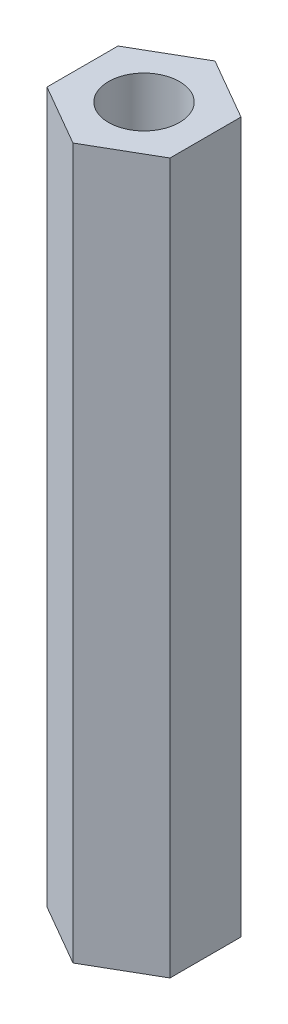
ISO-10303-21;
HEADER;
FILE_DESCRIPTION(('STEP AP214'),'2;1');
FILE_NAME('part.step','',(''),(''),'','','');
FILE_SCHEMA(('AUTOMOTIVE_DESIGN { 1 0 10303 214 1 1 1 1 }'));
ENDSEC;
DATA;
#1=APPLICATION_CONTEXT('core data for automotive mechanical design processes');
#2=APPLICATION_PROTOCOL_DEFINITION('international standard','automotive_design',2000,#1);
#3=PRODUCT_CONTEXT('',#1,'mechanical');
#4=PRODUCT('Part','Part','',(#3));
#5=PRODUCT_RELATED_PRODUCT_CATEGORY('part','',(#4));
#6=PRODUCT_DEFINITION_FORMATION('','',#4);
#7=PRODUCT_DEFINITION_CONTEXT('part definition',#1,'design');
#8=PRODUCT_DEFINITION('design','',#6,#7);
#9=PRODUCT_DEFINITION_SHAPE('','',#8);
#10=(LENGTH_UNIT() NAMED_UNIT(*) SI_UNIT(.MILLI.,.METRE.));
#11=(NAMED_UNIT(*) PLANE_ANGLE_UNIT() SI_UNIT($,.RADIAN.));
#12=(NAMED_UNIT(*) SI_UNIT($,.STERADIAN.) SOLID_ANGLE_UNIT());
#13=UNCERTAINTY_MEASURE_WITH_UNIT(LENGTH_MEASURE(1.E-05),#10,'distance_accuracy_value','');
#14=(GEOMETRIC_REPRESENTATION_CONTEXT(3) GLOBAL_UNCERTAINTY_ASSIGNED_CONTEXT((#13)) GLOBAL_UNIT_ASSIGNED_CONTEXT((#10,
#11,#12)) REPRESENTATION_CONTEXT('',''));
#15=CARTESIAN_POINT('',(0.,0.,0.));
#16=DIRECTION('',(0.,0.,1.));
#17=DIRECTION('',(1.,0.,0.));
#18=AXIS2_PLACEMENT_3D('',#15,#16,#17);
#19=CARTESIAN_POINT('',(0.,50.,-5.));
#20=DIRECTION('',(0.,1.,0.));
#21=DIRECTION('',(0.,0.,1.));
#22=AXIS2_PLACEMENT_3D('',#19,#20,#21);
#23=PLANE('',#22);
#24=DIRECTION('',(-0.866025403784439,0.,-0.5));
#25=VECTOR('',#24,1.);
#26=CARTESIAN_POINT('',(4.33012701892219,50.,-2.5));
#27=LINE('',#26,#25);
#28=CARTESIAN_POINT('',(4.33012701892219,50.,-2.5));
#29=VERTEX_POINT('',#28);
#30=CARTESIAN_POINT('',(0.,50.,-5.));
#31=VERTEX_POINT('',#30);
#32=EDGE_CURVE('E127',#29,#31,#27,.T.);
#33=ORIENTED_EDGE('',*,*,#32,.T.);
#34=DIRECTION('',(-0.866025403784439,0.,0.5));
#35=VECTOR('',#34,1.);
#36=CARTESIAN_POINT('',(0.,50.,-5.));
#37=LINE('',#36,#35);
#38=CARTESIAN_POINT('',(-4.33012701892219,50.,-2.5));
#39=VERTEX_POINT('',#38);
#40=EDGE_CURVE('E85',#31,#39,#37,.T.);
#41=ORIENTED_EDGE('',*,*,#40,.T.);
#42=DIRECTION('',(0.,0.,1.));
#43=VECTOR('',#42,1.);
#44=CARTESIAN_POINT('',(-4.33012701892219,50.,-2.5));
#45=LINE('',#44,#43);
#46=CARTESIAN_POINT('',(-4.33012701892219,50.,2.5));
#47=VERTEX_POINT('',#46);
#48=EDGE_CURVE('E98',#39,#47,#45,.T.);
#49=ORIENTED_EDGE('',*,*,#48,.T.);
#50=DIRECTION('',(0.866025403784439,0.,0.5));
#51=VECTOR('',#50,1.);
#52=CARTESIAN_POINT('',(-4.33012701892219,50.,2.5));
#53=LINE('',#52,#51);
#54=CARTESIAN_POINT('',(0.,50.,5.));
#55=VERTEX_POINT('',#54);
#56=EDGE_CURVE('E92',#47,#55,#53,.T.);
#57=ORIENTED_EDGE('',*,*,#56,.T.);
#58=DIRECTION('',(0.866025403784439,0.,-0.5));
#59=VECTOR('',#58,1.);
#60=CARTESIAN_POINT('',(0.,50.,5.));
#61=LINE('',#60,#59);
#62=CARTESIAN_POINT('',(4.33012701892219,50.,2.5));
#63=VERTEX_POINT('',#62);
#64=EDGE_CURVE('E96',#55,#63,#61,.T.);
#65=ORIENTED_EDGE('',*,*,#64,.T.);
#66=DIRECTION('',(0.,0.,-1.));
#67=VECTOR('',#66,1.);
#68=CARTESIAN_POINT('',(4.33012701892219,50.,2.5));
#69=LINE('',#68,#67);
#70=EDGE_CURVE('E48',#63,#29,#69,.T.);
#71=ORIENTED_EDGE('',*,*,#70,.T.);
#72=EDGE_LOOP('',(#33,#41,#49,#57,#65,#71));
#73=FACE_BOUND('',#72,.T.);
#74=CARTESIAN_POINT('',(0.,50.,0.));
#75=DIRECTION('',(0.,1.,0.));
#76=DIRECTION('',(0.,0.,1.));
#77=AXIS2_PLACEMENT_3D('',#74,#75,#76);
#78=CIRCLE('',#77,2.5);
#79=CARTESIAN_POINT('',(0.,50.,2.5));
#80=VERTEX_POINT('',#79);
#81=EDGE_CURVE('E120',#80,#80,#78,.T.);
#82=ORIENTED_EDGE('',*,*,#81,.F.);
#83=EDGE_LOOP('',(#82));
#84=FACE_BOUND('',#83,.T.);
#85=ADVANCED_FACE('F31',(#73,#84),#23,.T.);
#86=CARTESIAN_POINT('',(0.,0.,-5.));
#87=DIRECTION('',(0.,1.,0.));
#88=DIRECTION('',(0.,0.,1.));
#89=AXIS2_PLACEMENT_3D('',#86,#87,#88);
#90=PLANE('',#89);
#91=DIRECTION('',(-0.866025403784439,0.,-0.5));
#92=VECTOR('',#91,1.);
#93=CARTESIAN_POINT('',(4.33012701892219,0.,-2.5));
#94=LINE('',#93,#92);
#95=CARTESIAN_POINT('',(4.33012701892219,0.,-2.5));
#96=VERTEX_POINT('',#95);
#97=CARTESIAN_POINT('',(0.,0.,-5.));
#98=VERTEX_POINT('',#97);
#99=EDGE_CURVE('E116',#96,#98,#94,.T.);
#100=ORIENTED_EDGE('',*,*,#99,.F.);
#101=DIRECTION('',(0.,0.,-1.));
#102=VECTOR('',#101,1.);
#103=CARTESIAN_POINT('',(4.33012701892219,0.,2.5));
#104=LINE('',#103,#102);
#105=CARTESIAN_POINT('',(4.33012701892219,0.,2.5));
#106=VERTEX_POINT('',#105);
#107=EDGE_CURVE('E77',#106,#96,#104,.T.);
#108=ORIENTED_EDGE('',*,*,#107,.F.);
#109=DIRECTION('',(0.866025403784439,0.,-0.5));
#110=VECTOR('',#109,1.);
#111=CARTESIAN_POINT('',(0.,0.,5.));
#112=LINE('',#111,#110);
#113=CARTESIAN_POINT('',(0.,0.,5.));
#114=VERTEX_POINT('',#113);
#115=EDGE_CURVE('E71',#114,#106,#112,.T.);
#116=ORIENTED_EDGE('',*,*,#115,.F.);
#117=DIRECTION('',(0.866025403784439,0.,0.5));
#118=VECTOR('',#117,1.);
#119=CARTESIAN_POINT('',(-4.33012701892219,0.,2.5));
#120=LINE('',#119,#118);
#121=CARTESIAN_POINT('',(-4.33012701892219,0.,2.5));
#122=VERTEX_POINT('',#121);
#123=EDGE_CURVE('E106',#122,#114,#120,.T.);
#124=ORIENTED_EDGE('',*,*,#123,.F.);
#125=DIRECTION('',(0.,0.,1.));
#126=VECTOR('',#125,1.);
#127=CARTESIAN_POINT('',(-4.33012701892219,0.,-2.5));
#128=LINE('',#127,#126);
#129=CARTESIAN_POINT('',(-4.33012701892219,0.,-2.5));
#130=VERTEX_POINT('',#129);
#131=EDGE_CURVE('E122',#130,#122,#128,.T.);
#132=ORIENTED_EDGE('',*,*,#131,.F.);
#133=DIRECTION('',(-0.866025403784439,0.,0.5));
#134=VECTOR('',#133,1.);
#135=CARTESIAN_POINT('',(0.,0.,-5.));
#136=LINE('',#135,#134);
#137=EDGE_CURVE('E119',#98,#130,#136,.T.);
#138=ORIENTED_EDGE('',*,*,#137,.F.);
#139=EDGE_LOOP('',(#100,#108,#116,#124,#132,#138));
#140=FACE_BOUND('',#139,.T.);
#141=CARTESIAN_POINT('',(0.,0.,0.));
#142=DIRECTION('',(0.,1.,0.));
#143=DIRECTION('',(0.,0.,1.));
#144=AXIS2_PLACEMENT_3D('',#141,#142,#143);
#145=CIRCLE('',#144,2.5);
#146=CARTESIAN_POINT('',(0.,0.,2.5));
#147=VERTEX_POINT('',#146);
#148=EDGE_CURVE('E220',#147,#147,#145,.T.);
#149=ORIENTED_EDGE('',*,*,#148,.T.);
#150=EDGE_LOOP('',(#149));
#151=FACE_BOUND('',#150,.T.);
#152=ADVANCED_FACE('F136',(#140,#151),#90,.F.);
#153=CARTESIAN_POINT('',(4.33012701892219,50.,-2.5));
#154=DIRECTION('',(-0.5,0.,0.866025403784439));
#155=DIRECTION('',(0.866025403784439,0.,0.5));
#156=AXIS2_PLACEMENT_3D('',#153,#154,#155);
#157=PLANE('',#156);
#158=ORIENTED_EDGE('',*,*,#99,.T.);
#159=DIRECTION('',(0.,-1.,0.));
#160=VECTOR('',#159,1.);
#161=CARTESIAN_POINT('',(0.,50.,-5.));
#162=LINE('',#161,#160);
#163=EDGE_CURVE('E11',#31,#98,#162,.T.);
#164=ORIENTED_EDGE('',*,*,#163,.F.);
#165=ORIENTED_EDGE('',*,*,#32,.F.);
#166=DIRECTION('',(0.,-1.,0.));
#167=VECTOR('',#166,1.);
#168=CARTESIAN_POINT('',(4.33012701892219,50.,-2.5));
#169=LINE('',#168,#167);
#170=EDGE_CURVE('E112',#29,#96,#169,.T.);
#171=ORIENTED_EDGE('',*,*,#170,.T.);
#172=EDGE_LOOP('',(#158,#164,#165,#171));
#173=FACE_BOUND('',#172,.T.);
#174=ADVANCED_FACE('F33',(#173),#157,.F.);
#175=CARTESIAN_POINT('',(0.,50.,-5.));
#176=DIRECTION('',(0.5,0.,0.866025403784439));
#177=DIRECTION('',(0.866025403784439,0.,-0.5));
#178=AXIS2_PLACEMENT_3D('',#175,#176,#177);
#179=PLANE('',#178);
#180=ORIENTED_EDGE('',*,*,#137,.T.);
#181=DIRECTION('',(0.,-1.,0.));
#182=VECTOR('',#181,1.);
#183=CARTESIAN_POINT('',(-4.33012701892219,50.,-2.5));
#184=LINE('',#183,#182);
#185=EDGE_CURVE('E40',#39,#130,#184,.T.);
#186=ORIENTED_EDGE('',*,*,#185,.F.);
#187=ORIENTED_EDGE('',*,*,#40,.F.);
#188=ORIENTED_EDGE('',*,*,#163,.T.);
#189=EDGE_LOOP('',(#180,#186,#187,#188));
#190=FACE_BOUND('',#189,.T.);
#191=ADVANCED_FACE('F161',(#190),#179,.F.);
#192=CARTESIAN_POINT('',(-4.33012701892219,50.,-2.5));
#193=DIRECTION('',(1.,0.,0.));
#194=DIRECTION('',(0.,0.,-1.));
#195=AXIS2_PLACEMENT_3D('',#192,#193,#194);
#196=PLANE('',#195);
#197=ORIENTED_EDGE('',*,*,#131,.T.);
#198=DIRECTION('',(0.,-1.,0.));
#199=VECTOR('',#198,1.);
#200=CARTESIAN_POINT('',(-4.33012701892219,50.,2.5));
#201=LINE('',#200,#199);
#202=EDGE_CURVE('E107',#47,#122,#201,.T.);
#203=ORIENTED_EDGE('',*,*,#202,.F.);
#204=ORIENTED_EDGE('',*,*,#48,.F.);
#205=ORIENTED_EDGE('',*,*,#185,.T.);
#206=EDGE_LOOP('',(#197,#203,#204,#205));
#207=FACE_BOUND('',#206,.T.);
#208=ADVANCED_FACE('F133',(#207),#196,.F.);
#209=CARTESIAN_POINT('',(-4.33012701892219,50.,2.5));
#210=DIRECTION('',(0.5,0.,-0.866025403784439));
#211=DIRECTION('',(-0.866025403784439,0.,-0.5));
#212=AXIS2_PLACEMENT_3D('',#209,#210,#211);
#213=PLANE('',#212);
#214=ORIENTED_EDGE('',*,*,#123,.T.);
#215=DIRECTION('',(0.,-1.,0.));
#216=VECTOR('',#215,1.);
#217=CARTESIAN_POINT('',(0.,50.,5.));
#218=LINE('',#217,#216);
#219=EDGE_CURVE('E103',#55,#114,#218,.T.);
#220=ORIENTED_EDGE('',*,*,#219,.F.);
#221=ORIENTED_EDGE('',*,*,#56,.F.);
#222=ORIENTED_EDGE('',*,*,#202,.T.);
#223=EDGE_LOOP('',(#214,#220,#221,#222));
#224=FACE_BOUND('',#223,.T.);
#225=ADVANCED_FACE('F104',(#224),#213,.F.);
#226=CARTESIAN_POINT('',(0.,50.,5.));
#227=DIRECTION('',(-0.5,0.,-0.866025403784439));
#228=DIRECTION('',(-0.866025403784439,0.,0.5));
#229=AXIS2_PLACEMENT_3D('',#226,#227,#228);
#230=PLANE('',#229);
#231=ORIENTED_EDGE('',*,*,#115,.T.);
#232=DIRECTION('',(0.,-1.,0.));
#233=VECTOR('',#232,1.);
#234=CARTESIAN_POINT('',(4.33012701892219,50.,2.5));
#235=LINE('',#234,#233);
#236=EDGE_CURVE('E108',#63,#106,#235,.T.);
#237=ORIENTED_EDGE('',*,*,#236,.F.);
#238=ORIENTED_EDGE('',*,*,#64,.F.);
#239=ORIENTED_EDGE('',*,*,#219,.T.);
#240=EDGE_LOOP('',(#231,#237,#238,#239));
#241=FACE_BOUND('',#240,.T.);
#242=ADVANCED_FACE('F110',(#241),#230,.F.);
#243=CARTESIAN_POINT('',(4.33012701892219,50.,2.5));
#244=DIRECTION('',(-1.,0.,0.));
#245=DIRECTION('',(0.,0.,1.));
#246=AXIS2_PLACEMENT_3D('',#243,#244,#245);
#247=PLANE('',#246);
#248=ORIENTED_EDGE('',*,*,#107,.T.);
#249=ORIENTED_EDGE('',*,*,#170,.F.);
#250=ORIENTED_EDGE('',*,*,#70,.F.);
#251=ORIENTED_EDGE('',*,*,#236,.T.);
#252=EDGE_LOOP('',(#248,#249,#250,#251));
#253=FACE_BOUND('',#252,.T.);
#254=ADVANCED_FACE('F141',(#253),#247,.F.);
#255=CARTESIAN_POINT('',(0.,50.,0.));
#256=DIRECTION('',(0.,-1.,0.));
#257=DIRECTION('',(0.,0.,-1.));
#258=AXIS2_PLACEMENT_3D('',#255,#256,#257);
#259=CYLINDRICAL_SURFACE('',#258,2.5);
#260=ORIENTED_EDGE('',*,*,#81,.T.);
#261=EDGE_LOOP('',(#260));
#262=FACE_BOUND('',#261,.T.);
#263=ORIENTED_EDGE('',*,*,#148,.F.);
#264=EDGE_LOOP('',(#263));
#265=FACE_BOUND('',#264,.T.);
#266=ADVANCED_FACE('F143',(#262,#265),#259,.F.);
#267=CLOSED_SHELL('',(#85,#152,#174,#191,#208,#225,#242,#254,#266));
#268=MANIFOLD_SOLID_BREP('B2',#267);
#269=ADVANCED_BREP_SHAPE_REPRESENTATION('',(#18,#268),#14);
#270=SHAPE_DEFINITION_REPRESENTATION(#9,#269);
ENDSEC;
END-ISO-10303-21;
